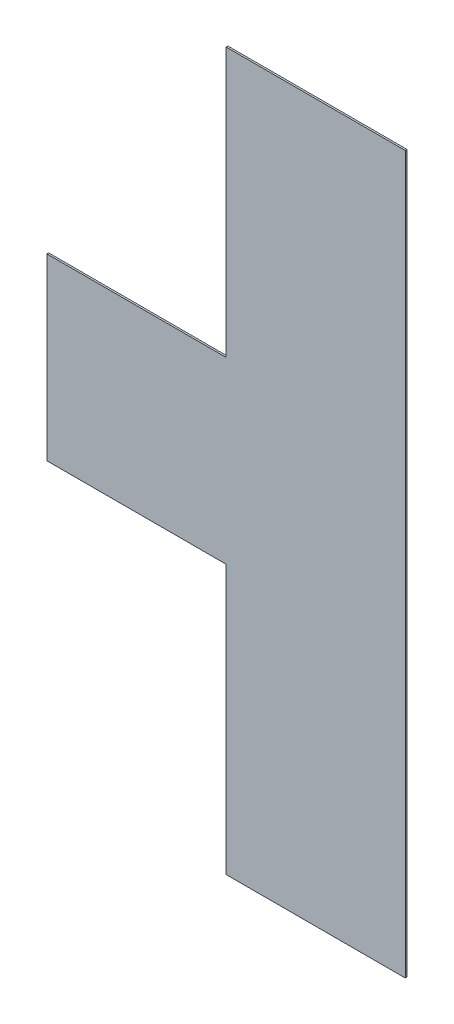
ISO-10303-21;
HEADER;
FILE_DESCRIPTION(('STEP AP214'),'2;1');
FILE_NAME('part.step','',(''),(''),'','','');
FILE_SCHEMA(('AUTOMOTIVE_DESIGN { 1 0 10303 214 1 1 1 1 }'));
ENDSEC;
DATA;
#1=APPLICATION_CONTEXT('core data for automotive mechanical design processes');
#2=APPLICATION_PROTOCOL_DEFINITION('international standard','automotive_design',2000,#1);
#3=PRODUCT_CONTEXT('',#1,'mechanical');
#4=PRODUCT('Part','Part','',(#3));
#5=PRODUCT_RELATED_PRODUCT_CATEGORY('part','',(#4));
#6=PRODUCT_DEFINITION_FORMATION('','',#4);
#7=PRODUCT_DEFINITION_CONTEXT('part definition',#1,'design');
#8=PRODUCT_DEFINITION('design','',#6,#7);
#9=PRODUCT_DEFINITION_SHAPE('','',#8);
#10=(LENGTH_UNIT() NAMED_UNIT(*) SI_UNIT(.MILLI.,.METRE.));
#11=(NAMED_UNIT(*) PLANE_ANGLE_UNIT() SI_UNIT($,.RADIAN.));
#12=(NAMED_UNIT(*) SI_UNIT($,.STERADIAN.) SOLID_ANGLE_UNIT());
#13=UNCERTAINTY_MEASURE_WITH_UNIT(LENGTH_MEASURE(1.E-05),#10,'distance_accuracy_value','');
#14=(GEOMETRIC_REPRESENTATION_CONTEXT(3) GLOBAL_UNCERTAINTY_ASSIGNED_CONTEXT((#13)) GLOBAL_UNIT_ASSIGNED_CONTEXT((#10,
#11,#12)) REPRESENTATION_CONTEXT('',''));
#15=CARTESIAN_POINT('',(0.,0.,0.));
#16=DIRECTION('',(0.,0.,1.));
#17=DIRECTION('',(1.,0.,0.));
#18=AXIS2_PLACEMENT_3D('',#15,#16,#17);
#19=CARTESIAN_POINT('',(0.2,0.4,0.));
#20=DIRECTION('',(0.,0.,1.));
#21=DIRECTION('',(0.,-1.,0.));
#22=AXIS2_PLACEMENT_3D('',#19,#20,#21);
#23=PLANE('',#22);
#24=DIRECTION('',(1.,0.,0.));
#25=VECTOR('',#24,1.);
#26=CARTESIAN_POINT('',(0.2,-0.4,0.));
#27=LINE('',#26,#25);
#28=CARTESIAN_POINT('',(0.,-0.4,0.));
#29=VERTEX_POINT('',#28);
#30=CARTESIAN_POINT('',(0.2,-0.4,0.));
#31=VERTEX_POINT('',#30);
#32=EDGE_CURVE('E11',#29,#31,#27,.T.);
#33=ORIENTED_EDGE('',*,*,#32,.F.);
#34=DIRECTION('',(0.,-1.,0.));
#35=VECTOR('',#34,1.);
#36=CARTESIAN_POINT('',(0.,0.4,0.));
#37=LINE('',#36,#35);
#38=CARTESIAN_POINT('',(0.,-0.1,0.));
#39=VERTEX_POINT('',#38);
#40=EDGE_CURVE('E25',#39,#29,#37,.T.);
#41=ORIENTED_EDGE('',*,*,#40,.F.);
#42=DIRECTION('',(1.,0.,0.));
#43=VECTOR('',#42,1.);
#44=CARTESIAN_POINT('',(0.2,-0.1,0.));
#45=LINE('',#44,#43);
#46=CARTESIAN_POINT('',(-0.2,-0.1,0.));
#47=VERTEX_POINT('',#46);
#48=EDGE_CURVE('E142',#47,#39,#45,.T.);
#49=ORIENTED_EDGE('',*,*,#48,.F.);
#50=DIRECTION('',(0.,-1.,0.));
#51=VECTOR('',#50,1.);
#52=CARTESIAN_POINT('',(-0.2,0.4,0.));
#53=LINE('',#52,#51);
#54=CARTESIAN_POINT('',(-0.2,0.1,0.));
#55=VERTEX_POINT('',#54);
#56=EDGE_CURVE('E137',#55,#47,#53,.T.);
#57=ORIENTED_EDGE('',*,*,#56,.F.);
#58=DIRECTION('',(-1.,0.,0.));
#59=VECTOR('',#58,1.);
#60=CARTESIAN_POINT('',(0.2,0.1,0.));
#61=LINE('',#60,#59);
#62=CARTESIAN_POINT('',(0.,0.1,0.));
#63=VERTEX_POINT('',#62);
#64=EDGE_CURVE('E132',#63,#55,#61,.T.);
#65=ORIENTED_EDGE('',*,*,#64,.F.);
#66=DIRECTION('',(0.,-1.,0.));
#67=VECTOR('',#66,1.);
#68=CARTESIAN_POINT('',(0.,0.4,0.));
#69=LINE('',#68,#67);
#70=CARTESIAN_POINT('',(0.,0.4,0.));
#71=VERTEX_POINT('',#70);
#72=EDGE_CURVE('E127',#71,#63,#69,.T.);
#73=ORIENTED_EDGE('',*,*,#72,.F.);
#74=DIRECTION('',(-1.,0.,0.));
#75=VECTOR('',#74,1.);
#76=CARTESIAN_POINT('',(0.2,0.4,0.));
#77=LINE('',#76,#75);
#78=CARTESIAN_POINT('',(0.2,0.4,0.));
#79=VERTEX_POINT('',#78);
#80=EDGE_CURVE('E122',#79,#71,#77,.T.);
#81=ORIENTED_EDGE('',*,*,#80,.F.);
#82=DIRECTION('',(0.,1.,0.));
#83=VECTOR('',#82,1.);
#84=CARTESIAN_POINT('',(0.2,0.4,0.));
#85=LINE('',#84,#83);
#86=EDGE_CURVE('E117',#31,#79,#85,.T.);
#87=ORIENTED_EDGE('',*,*,#86,.F.);
#88=EDGE_LOOP('',(#33,#41,#49,#57,#65,#73,#81,#87));
#89=FACE_BOUND('',#88,.T.);
#90=ADVANCED_FACE('F17',(#89),#23,.F.);
#91=CARTESIAN_POINT('',(0.2,0.4,0.));
#92=DIRECTION('',(1.,0.,0.));
#93=DIRECTION('',(0.,0.,-1.));
#94=AXIS2_PLACEMENT_3D('',#91,#92,#93);
#95=PLANE('',#94);
#96=DIRECTION('',(0.,0.,-1.));
#97=VECTOR('',#96,1.);
#98=CARTESIAN_POINT('',(0.2,-0.4,0.));
#99=LINE('',#98,#97);
#100=CARTESIAN_POINT('',(0.2,-0.4,0.002));
#101=VERTEX_POINT('',#100);
#102=EDGE_CURVE('E98',#101,#31,#99,.T.);
#103=ORIENTED_EDGE('',*,*,#102,.T.);
#104=ORIENTED_EDGE('',*,*,#86,.T.);
#105=DIRECTION('',(0.,0.,1.));
#106=VECTOR('',#105,1.);
#107=CARTESIAN_POINT('',(0.2,0.4,0.));
#108=LINE('',#107,#106);
#109=CARTESIAN_POINT('',(0.2,0.4,0.002));
#110=VERTEX_POINT('',#109);
#111=EDGE_CURVE('E102',#79,#110,#108,.T.);
#112=ORIENTED_EDGE('',*,*,#111,.T.);
#113=DIRECTION('',(0.,-1.,0.));
#114=VECTOR('',#113,1.);
#115=CARTESIAN_POINT('',(0.2,0.4,0.002));
#116=LINE('',#115,#114);
#117=EDGE_CURVE('E99',#110,#101,#116,.T.);
#118=ORIENTED_EDGE('',*,*,#117,.T.);
#119=EDGE_LOOP('',(#103,#104,#112,#118));
#120=FACE_BOUND('',#119,.T.);
#121=ADVANCED_FACE('F182',(#120),#95,.T.);
#122=CARTESIAN_POINT('',(0.2,0.4,0.002));
#123=DIRECTION('',(0.,0.,1.));
#124=DIRECTION('',(0.,-1.,0.));
#125=AXIS2_PLACEMENT_3D('',#122,#123,#124);
#126=PLANE('',#125);
#127=DIRECTION('',(-1.,0.,0.));
#128=VECTOR('',#127,1.);
#129=CARTESIAN_POINT('',(0.2,-0.4,0.002));
#130=LINE('',#129,#128);
#131=CARTESIAN_POINT('',(0.,-0.4,0.002));
#132=VERTEX_POINT('',#131);
#133=EDGE_CURVE('E83',#101,#132,#130,.T.);
#134=ORIENTED_EDGE('',*,*,#133,.F.);
#135=ORIENTED_EDGE('',*,*,#117,.F.);
#136=DIRECTION('',(-1.,0.,0.));
#137=VECTOR('',#136,1.);
#138=CARTESIAN_POINT('',(0.2,0.4,0.002));
#139=LINE('',#138,#137);
#140=CARTESIAN_POINT('',(0.,0.4,0.002));
#141=VERTEX_POINT('',#140);
#142=EDGE_CURVE('E100',#110,#141,#139,.T.);
#143=ORIENTED_EDGE('',*,*,#142,.T.);
#144=DIRECTION('',(0.,-1.,0.));
#145=VECTOR('',#144,1.);
#146=CARTESIAN_POINT('',(0.,0.4,0.002));
#147=LINE('',#146,#145);
#148=CARTESIAN_POINT('',(0.,0.1,0.002));
#149=VERTEX_POINT('',#148);
#150=EDGE_CURVE('E104',#141,#149,#147,.T.);
#151=ORIENTED_EDGE('',*,*,#150,.T.);
#152=DIRECTION('',(-1.,0.,0.));
#153=VECTOR('',#152,1.);
#154=CARTESIAN_POINT('',(0.,0.1,0.002));
#155=LINE('',#154,#153);
#156=CARTESIAN_POINT('',(-0.2,0.1,0.002));
#157=VERTEX_POINT('',#156);
#158=EDGE_CURVE('E169',#149,#157,#155,.T.);
#159=ORIENTED_EDGE('',*,*,#158,.T.);
#160=DIRECTION('',(0.,1.,0.));
#161=VECTOR('',#160,1.);
#162=CARTESIAN_POINT('',(-0.2,-0.1,0.002));
#163=LINE('',#162,#161);
#164=CARTESIAN_POINT('',(-0.2,-0.1,0.002));
#165=VERTEX_POINT('',#164);
#166=EDGE_CURVE('E162',#165,#157,#163,.T.);
#167=ORIENTED_EDGE('',*,*,#166,.F.);
#168=DIRECTION('',(-1.,0.,0.));
#169=VECTOR('',#168,1.);
#170=CARTESIAN_POINT('',(0.,-0.1,0.002));
#171=LINE('',#170,#169);
#172=CARTESIAN_POINT('',(0.,-0.1,0.002));
#173=VERTEX_POINT('',#172);
#174=EDGE_CURVE('E86',#173,#165,#171,.T.);
#175=ORIENTED_EDGE('',*,*,#174,.F.);
#176=DIRECTION('',(0.,1.,0.));
#177=VECTOR('',#176,1.);
#178=CARTESIAN_POINT('',(0.,-0.4,0.002));
#179=LINE('',#178,#177);
#180=EDGE_CURVE('E78',#132,#173,#179,.T.);
#181=ORIENTED_EDGE('',*,*,#180,.F.);
#182=EDGE_LOOP('',(#134,#135,#143,#151,#159,#167,#175,#181));
#183=FACE_BOUND('',#182,.T.);
#184=ADVANCED_FACE('F80',(#183),#126,.T.);
#185=CARTESIAN_POINT('',(0.,-0.4,0.));
#186=DIRECTION('',(-1.,0.,0.));
#187=DIRECTION('',(0.,0.,1.));
#188=AXIS2_PLACEMENT_3D('',#185,#186,#187);
#189=PLANE('',#188);
#190=DIRECTION('',(0.,0.,-1.));
#191=VECTOR('',#190,1.);
#192=CARTESIAN_POINT('',(0.,-0.1,0.));
#193=LINE('',#192,#191);
#194=EDGE_CURVE('E89',#173,#39,#193,.T.);
#195=ORIENTED_EDGE('',*,*,#194,.T.);
#196=ORIENTED_EDGE('',*,*,#40,.T.);
#197=DIRECTION('',(0.,0.,-1.));
#198=VECTOR('',#197,1.);
#199=CARTESIAN_POINT('',(0.,-0.4,0.));
#200=LINE('',#199,#198);
#201=EDGE_CURVE('E91',#132,#29,#200,.T.);
#202=ORIENTED_EDGE('',*,*,#201,.F.);
#203=ORIENTED_EDGE('',*,*,#180,.T.);
#204=EDGE_LOOP('',(#195,#196,#202,#203));
#205=FACE_BOUND('',#204,.T.);
#206=ADVANCED_FACE('F92',(#205),#189,.T.);
#207=CARTESIAN_POINT('',(0.2,-0.4,0.));
#208=DIRECTION('',(0.,-1.,0.));
#209=DIRECTION('',(0.,0.,-1.));
#210=AXIS2_PLACEMENT_3D('',#207,#208,#209);
#211=PLANE('',#210);
#212=ORIENTED_EDGE('',*,*,#201,.T.);
#213=ORIENTED_EDGE('',*,*,#32,.T.);
#214=ORIENTED_EDGE('',*,*,#102,.F.);
#215=ORIENTED_EDGE('',*,*,#133,.T.);
#216=EDGE_LOOP('',(#212,#213,#214,#215));
#217=FACE_BOUND('',#216,.T.);
#218=ADVANCED_FACE('F96',(#217),#211,.T.);
#219=CARTESIAN_POINT('',(0.,-0.1,0.));
#220=DIRECTION('',(0.,-1.,0.));
#221=DIRECTION('',(0.,0.,-1.));
#222=AXIS2_PLACEMENT_3D('',#219,#220,#221);
#223=PLANE('',#222);
#224=DIRECTION('',(0.,0.,-1.));
#225=VECTOR('',#224,1.);
#226=CARTESIAN_POINT('',(-0.2,-0.1,0.));
#227=LINE('',#226,#225);
#228=EDGE_CURVE('E94',#165,#47,#227,.T.);
#229=ORIENTED_EDGE('',*,*,#228,.T.);
#230=ORIENTED_EDGE('',*,*,#48,.T.);
#231=ORIENTED_EDGE('',*,*,#194,.F.);
#232=ORIENTED_EDGE('',*,*,#174,.T.);
#233=EDGE_LOOP('',(#229,#230,#231,#232));
#234=FACE_BOUND('',#233,.T.);
#235=ADVANCED_FACE('F153',(#234),#223,.T.);
#236=CARTESIAN_POINT('',(-0.2,-0.1,0.));
#237=DIRECTION('',(-1.,0.,0.));
#238=DIRECTION('',(0.,0.,1.));
#239=AXIS2_PLACEMENT_3D('',#236,#237,#238);
#240=PLANE('',#239);
#241=DIRECTION('',(0.,0.,-1.));
#242=VECTOR('',#241,1.);
#243=CARTESIAN_POINT('',(-0.2,0.1,0.));
#244=LINE('',#243,#242);
#245=EDGE_CURVE('E160',#157,#55,#244,.T.);
#246=ORIENTED_EDGE('',*,*,#245,.T.);
#247=ORIENTED_EDGE('',*,*,#56,.T.);
#248=ORIENTED_EDGE('',*,*,#228,.F.);
#249=ORIENTED_EDGE('',*,*,#166,.T.);
#250=EDGE_LOOP('',(#246,#247,#248,#249));
#251=FACE_BOUND('',#250,.T.);
#252=ADVANCED_FACE('F161',(#251),#240,.T.);
#253=CARTESIAN_POINT('',(0.,0.1,0.));
#254=DIRECTION('',(0.,-1.,0.));
#255=DIRECTION('',(0.,0.,-1.));
#256=AXIS2_PLACEMENT_3D('',#253,#254,#255);
#257=PLANE('',#256);
#258=ORIENTED_EDGE('',*,*,#245,.F.);
#259=ORIENTED_EDGE('',*,*,#158,.F.);
#260=DIRECTION('',(0.,0.,1.));
#261=VECTOR('',#260,1.);
#262=CARTESIAN_POINT('',(0.,0.1,0.));
#263=LINE('',#262,#261);
#264=EDGE_CURVE('E165',#63,#149,#263,.T.);
#265=ORIENTED_EDGE('',*,*,#264,.F.);
#266=ORIENTED_EDGE('',*,*,#64,.T.);
#267=EDGE_LOOP('',(#258,#259,#265,#266));
#268=FACE_BOUND('',#267,.T.);
#269=ADVANCED_FACE('F167',(#268),#257,.F.);
#270=CARTESIAN_POINT('',(0.,0.4,0.));
#271=DIRECTION('',(1.,0.,0.));
#272=DIRECTION('',(0.,0.,-1.));
#273=AXIS2_PLACEMENT_3D('',#270,#271,#272);
#274=PLANE('',#273);
#275=ORIENTED_EDGE('',*,*,#264,.T.);
#276=ORIENTED_EDGE('',*,*,#150,.F.);
#277=DIRECTION('',(0.,0.,1.));
#278=VECTOR('',#277,1.);
#279=CARTESIAN_POINT('',(0.,0.4,0.));
#280=LINE('',#279,#278);
#281=EDGE_CURVE('E172',#71,#141,#280,.T.);
#282=ORIENTED_EDGE('',*,*,#281,.F.);
#283=ORIENTED_EDGE('',*,*,#72,.T.);
#284=EDGE_LOOP('',(#275,#276,#282,#283));
#285=FACE_BOUND('',#284,.T.);
#286=ADVANCED_FACE('F175',(#285),#274,.F.);
#287=CARTESIAN_POINT('',(0.2,0.4,0.));
#288=DIRECTION('',(0.,-1.,0.));
#289=DIRECTION('',(0.,0.,-1.));
#290=AXIS2_PLACEMENT_3D('',#287,#288,#289);
#291=PLANE('',#290);
#292=ORIENTED_EDGE('',*,*,#281,.T.);
#293=ORIENTED_EDGE('',*,*,#142,.F.);
#294=ORIENTED_EDGE('',*,*,#111,.F.);
#295=ORIENTED_EDGE('',*,*,#80,.T.);
#296=EDGE_LOOP('',(#292,#293,#294,#295));
#297=FACE_BOUND('',#296,.T.);
#298=ADVANCED_FACE('F180',(#297),#291,.F.);
#299=CLOSED_SHELL('',(#90,#121,#184,#206,#218,#235,#252,#269,#286,#298));
#300=MANIFOLD_SOLID_BREP('B1',#299);
#301=ADVANCED_BREP_SHAPE_REPRESENTATION('',(#18,#300),#14);
#302=SHAPE_DEFINITION_REPRESENTATION(#9,#301);
ENDSEC;
END-ISO-10303-21;
